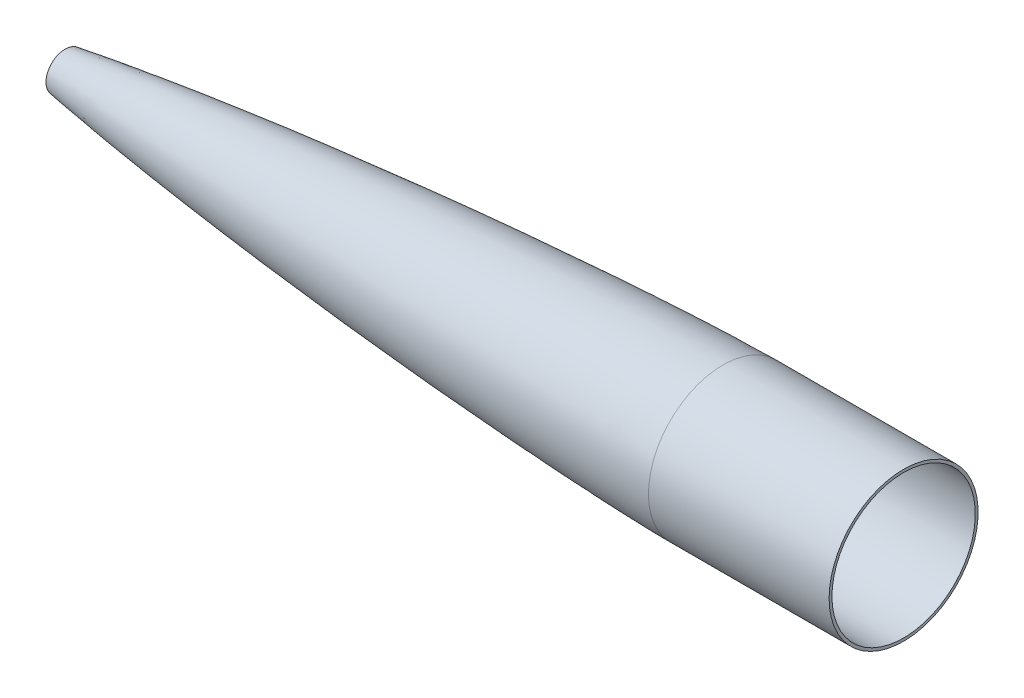
ISO-10303-21;
HEADER;
FILE_DESCRIPTION(('STEP AP214'),'2;1');
FILE_NAME('part.step','',(''),(''),'','','');
FILE_SCHEMA(('AUTOMOTIVE_DESIGN { 1 0 10303 214 1 1 1 1 }'));
ENDSEC;
DATA;
#1=APPLICATION_CONTEXT('core data for automotive mechanical design processes');
#2=APPLICATION_PROTOCOL_DEFINITION('international standard','automotive_design',2000,#1);
#3=PRODUCT_CONTEXT('',#1,'mechanical');
#4=PRODUCT('Part','Part','',(#3));
#5=PRODUCT_RELATED_PRODUCT_CATEGORY('part','',(#4));
#6=PRODUCT_DEFINITION_FORMATION('','',#4);
#7=PRODUCT_DEFINITION_CONTEXT('part definition',#1,'design');
#8=PRODUCT_DEFINITION('design','',#6,#7);
#9=PRODUCT_DEFINITION_SHAPE('','',#8);
#10=(LENGTH_UNIT() NAMED_UNIT(*) SI_UNIT(.MILLI.,.METRE.));
#11=(NAMED_UNIT(*) PLANE_ANGLE_UNIT() SI_UNIT($,.RADIAN.));
#12=(NAMED_UNIT(*) SI_UNIT($,.STERADIAN.) SOLID_ANGLE_UNIT());
#13=UNCERTAINTY_MEASURE_WITH_UNIT(LENGTH_MEASURE(1.E-05),#10,'distance_accuracy_value','');
#14=(GEOMETRIC_REPRESENTATION_CONTEXT(3) GLOBAL_UNCERTAINTY_ASSIGNED_CONTEXT((#13)) GLOBAL_UNIT_ASSIGNED_CONTEXT((#10,
#11,#12)) REPRESENTATION_CONTEXT('',''));
#15=CARTESIAN_POINT('',(0.,0.,0.));
#16=DIRECTION('',(0.,0.,1.));
#17=DIRECTION('',(1.,0.,0.));
#18=AXIS2_PLACEMENT_3D('',#15,#16,#17);
#19=CARTESIAN_POINT('',(-497.100050165792,-29.1260697314375,34.219815841027));
#20=DIRECTION('',(-1.,0.,0.));
#21=DIRECTION('',(0.,0.,1.));
#22=AXIS2_PLACEMENT_3D('',#19,#20,#21);
#23=TOROIDAL_SURFACE('',#22,19.05,9.525);
#24=CARTESIAN_POINT('',(-487.719756318354,-29.1260697314375,34.219815841027));
#25=DIRECTION('',(1.,0.,0.));
#26=DIRECTION('',(0.,0.,-1.));
#27=AXIS2_PLACEMENT_3D('',#24,#25,#26);
#28=CIRCLE('',#27,17.3960011077034);
#29=CARTESIAN_POINT('',(-487.719756318354,-29.1260697314375,16.8238147333237));
#30=VERTEX_POINT('',#29);
#31=EDGE_CURVE('E192',#30,#30,#28,.T.);
#32=ORIENTED_EDGE('',*,*,#31,.T.);
#33=EDGE_LOOP('',(#32));
#34=FACE_BOUND('',#33,.T.);
#35=CARTESIAN_POINT('',(-488.301278228721,-29.1260697314375,34.219815841027));
#36=DIRECTION('',(-1.,0.,0.));
#37=DIRECTION('',(0.,0.,1.));
#38=AXIS2_PLACEMENT_3D('',#35,#36,#37);
#39=CIRCLE('',#38,15.4020913663565);
#40=CARTESIAN_POINT('',(-488.301278228721,-29.1260697314375,49.6219072073836));
#41=VERTEX_POINT('',#40);
#42=EDGE_CURVE('E36',#41,#41,#39,.T.);
#43=ORIENTED_EDGE('',*,*,#42,.T.);
#44=EDGE_LOOP('',(#43));
#45=FACE_BOUND('',#44,.T.);
#46=ADVANCED_FACE('F32',(#34,#45),#23,.T.);
#47=CARTESIAN_POINT('',(-490.226191636893,-29.1260697314375,34.219815841027));
#48=DIRECTION('',(1.,0.,0.));
#49=DIRECTION('',(0.,0.,-1.));
#50=AXIS2_PLACEMENT_3D('',#47,#48,#49);
#51=CONICAL_SURFACE('',#50,21.4653963375631,1.39626340159342);
#52=CARTESIAN_POINT('',(-490.846520934166,-29.1260697314375,34.219815841027));
#53=DIRECTION('',(1.,0.,0.));
#54=DIRECTION('',(0.,0.,-1.));
#55=AXIS2_PLACEMENT_3D('',#52,#53,#54);
#56=CIRCLE('',#55,17.9473340718022);
#57=CARTESIAN_POINT('',(-490.846520934166,-29.1260697314375,16.2724817692248));
#58=VERTEX_POINT('',#57);
#59=EDGE_CURVE('E99',#58,#58,#56,.T.);
#60=ORIENTED_EDGE('',*,*,#59,.T.);
#61=EDGE_LOOP('',(#60));
#62=FACE_BOUND('',#61,.T.);
#63=CARTESIAN_POINT('',(-490.226191636893,-29.1260697314375,34.219815841027));
#64=DIRECTION('',(-1.,0.,0.));
#65=DIRECTION('',(0.,0.,1.));
#66=AXIS2_PLACEMENT_3D('',#63,#64,#65);
#67=CIRCLE('',#66,21.4653963375631);
#68=CARTESIAN_POINT('',(-490.226191636893,-29.1260697314375,55.6852121785901));
#69=VERTEX_POINT('',#68);
#70=EDGE_CURVE('E44',#69,#69,#67,.T.);
#71=ORIENTED_EDGE('',*,*,#70,.T.);
#72=EDGE_LOOP('',(#71));
#73=FACE_BOUND('',#72,.T.);
#74=ADVANCED_FACE('F85',(#62,#73),#51,.T.);
#75=CARTESIAN_POINT('',(257.178547359631,-29.1260697314381,118.058414165423));
#76=CARTESIAN_POINT('',(255.320899442672,-29.1260697314381,118.053764584324));
#77=CARTESIAN_POINT('',(253.463251525713,-29.1260697314381,118.049115003225));
#78=CARTESIAN_POINT('',(251.605603608755,-29.1260697314381,118.044465422126));
#79=CARTESIAN_POINT('',(249.747955691796,-29.1260697314381,118.039815841027));
#80=CARTESIAN_POINT('',(247.037204587574,-29.1260697314381,118.033030993918));
#81=CARTESIAN_POINT('',(241.615892749251,-29.1260697314381,117.981603725061));
#82=CARTESIAN_POINT('',(230.774019349644,-29.1260697314381,117.820517181401));
#83=CARTESIAN_POINT('',(213.457799954454,-29.1260697314381,117.433496013967));
#84=CARTESIAN_POINT('',(192.379641652368,-29.126069731438,116.816839150635));
#85=CARTESIAN_POINT('',(161.068693107867,-29.126069731438,115.689740348816));
#86=CARTESIAN_POINT('',(122.241235941685,-29.126069731438,113.988999174482));
#87=CARTESIAN_POINT('',(76.9597173213895,-29.126069731438,111.644045536759));
#88=CARTESIAN_POINT('',(25.2331815247483,-29.126069731438,108.541239256283));
#89=CARTESIAN_POINT('',(-26.4689224169223,-29.126069731438,105.055962688181));
#90=CARTESIAN_POINT('',(-78.1453992899658,-29.1260697314379,101.209907448607));
#91=CARTESIAN_POINT('',(-129.794537127088,-29.1260697314379,97.0125928680635));
#92=CARTESIAN_POINT('',(-181.413804983064,-29.1260697314379,92.4627350675098));
#93=CARTESIAN_POINT('',(-232.999839264732,-29.1260697314378,87.5496015046126));
#94=CARTESIAN_POINT('',(-284.547598412156,-29.1260697314378,82.249774320463));
#95=CARTESIAN_POINT('',(-336.050232479862,-29.1260697314378,76.5260238420661));
#96=CARTESIAN_POINT('',(-387.496474424648,-29.1260697314377,70.314936150988));
#97=CARTESIAN_POINT('',(-432.48003869913,-29.1260697314377,64.3629107800199));
#98=CARTESIAN_POINT('',(-464.564279917598,-29.1260697314376,59.7061827137547));
#99=CARTESIAN_POINT('',(-483.797715701709,-29.1260697314376,56.7125369941234));
#100=CARTESIAN_POINT('',(-490.226191636893,-29.1260697314376,55.6852121785901));
#101=CARTESIAN_POINT('',(-492.078911817164,-29.1260697314376,55.3891318266339));
#102=CARTESIAN_POINT('',(-493.931631997434,-29.1260697314376,55.0930514746777));
#103=CARTESIAN_POINT('',(-495.784352177705,-29.1260697314376,54.7969711227215));
#104=CARTESIAN_POINT('',(-497.637072357976,-29.1260697314376,54.5008907707654));
#105=B_SPLINE_CURVE_WITH_KNOTS('',4,(#75,#76,#77,#78,#79,#80,#81,#82,#83,#84,#85,#86,#87,#88,
#89,#90,#91,#92,#93,#94,#95,#96,#97,#98,#99,#100,#101,#102,#103,#104),.UNSPECIFIED.,.F.,.F.,(5,
4,1,1,1,1,1,1,1,1,1,1,1,1,1,1,1,1,1,4,5),(0.110650562347268,0.119456002324028,0.132305238135753,
0.145154473947477,0.170852945570926,0.20155636317632,0.232259780781714,0.293666616471375,
0.355073450910404,0.416480286041621,0.477887121742557,0.539293956594942,0.600700791172677,
0.662107626008528,0.72351446097545,0.784921295902826,0.846328130529149,0.907734964455163,
0.969141797456508,1.,1.00889349437653),.UNSPECIFIED.);
#106=CARTESIAN_POINT('',(467.335847272882,-29.1260697314375,34.219815841027));
#107=DIRECTION('',(-1.,0.,0.));
#108=AXIS1_PLACEMENT('',#106,#107);
#109=SURFACE_OF_REVOLUTION('',#105,#108);
#110=ORIENTED_EDGE('',*,*,#70,.F.);
#111=EDGE_LOOP('',(#110));
#112=FACE_BOUND('',#111,.T.);
#113=CARTESIAN_POINT('',(249.747955691796,-29.1260697314375,34.219815841027));
#114=DIRECTION('',(-1.,0.,0.));
#115=DIRECTION('',(0.,0.,1.));
#116=AXIS2_PLACEMENT_3D('',#113,#114,#115);
#117=CIRCLE('',#116,83.8199999999999);
#118=CARTESIAN_POINT('',(249.747955691796,-29.1260697314375,118.039815841027));
#119=VERTEX_POINT('',#118);
#120=EDGE_CURVE('E40',#119,#119,#117,.T.);
#121=ORIENTED_EDGE('',*,*,#120,.T.);
#122=EDGE_LOOP('',(#121));
#123=FACE_BOUND('',#122,.T.);
#124=ADVANCED_FACE('F90',(#112,#123),#109,.T.);
#125=CARTESIAN_POINT('',(467.335847272882,-29.1260697314375,34.219815841027));
#126=DIRECTION('',(-1.,0.,0.));
#127=DIRECTION('',(0.,0.,1.));
#128=AXIS2_PLACEMENT_3D('',#125,#126,#127);
#129=CYLINDRICAL_SURFACE('',#128,83.8199999999999);
#130=ORIENTED_EDGE('',*,*,#120,.F.);
#131=EDGE_LOOP('',(#130));
#132=FACE_BOUND('',#131,.T.);
#133=CARTESIAN_POINT('',(452.947955691796,-29.1260697314375,34.219815841027));
#134=DIRECTION('',(-1.,0.,0.));
#135=DIRECTION('',(0.,0.,1.));
#136=AXIS2_PLACEMENT_3D('',#133,#134,#135);
#137=CIRCLE('',#136,83.8199999999999);
#138=CARTESIAN_POINT('',(452.947955691796,-29.1260697314375,118.039815841027));
#139=VERTEX_POINT('',#138);
#140=EDGE_CURVE('E10',#139,#139,#137,.T.);
#141=ORIENTED_EDGE('',*,*,#140,.T.);
#142=EDGE_LOOP('',(#141));
#143=FACE_BOUND('',#142,.T.);
#144=ADVANCED_FACE('F34',(#132,#143),#129,.T.);
#145=CARTESIAN_POINT('',(452.947955691796,-29.1260697314375,34.219815841027));
#146=DIRECTION('',(1.,0.,0.));
#147=DIRECTION('',(0.,1.,0.));
#148=AXIS2_PLACEMENT_3D('',#145,#146,#147);
#149=PLANE('',#148);
#150=CARTESIAN_POINT('',(452.947955691796,-29.1260697314375,34.219815841027));
#151=DIRECTION('',(1.,0.,0.));
#152=DIRECTION('',(0.,1.,0.));
#153=AXIS2_PLACEMENT_3D('',#150,#151,#152);
#154=CIRCLE('',#153,80.6449999999999);
#155=CARTESIAN_POINT('',(452.947955691796,51.5189302685625,34.219815841027));
#156=VERTEX_POINT('',#155);
#157=EDGE_CURVE('E49',#156,#156,#154,.F.);
#158=ORIENTED_EDGE('',*,*,#157,.T.);
#159=EDGE_LOOP('',(#158));
#160=FACE_BOUND('',#159,.T.);
#161=ORIENTED_EDGE('',*,*,#140,.F.);
#162=EDGE_LOOP('',(#161));
#163=FACE_BOUND('',#162,.T.);
#164=ADVANCED_FACE('F81',(#160,#163),#149,.T.);
#165=CARTESIAN_POINT('',(-487.099427021081,-29.1260697314375,34.219815841027));
#166=DIRECTION('',(1.,0.,0.));
#167=DIRECTION('',(0.,0.,-1.));
#168=AXIS2_PLACEMENT_3D('',#165,#166,#167);
#169=CONICAL_SURFACE('',#168,20.9140633734642,1.39626340159342);
#170=ORIENTED_EDGE('',*,*,#31,.F.);
#171=EDGE_LOOP('',(#170));
#172=FACE_BOUND('',#171,.T.);
#173=CARTESIAN_POINT('',(-487.49232966141,-29.1260697314375,34.219815841027));
#174=DIRECTION('',(-1.,0.,0.));
#175=DIRECTION('',(0.,0.,1.));
#176=AXIS2_PLACEMENT_3D('',#173,#174,#175);
#177=CIRCLE('',#176,18.6858017725101);
#178=CARTESIAN_POINT('',(-487.49232966141,-29.1260697314375,52.9056176135371));
#179=VERTEX_POINT('',#178);
#180=EDGE_CURVE('E198',#179,#179,#177,.T.);
#181=ORIENTED_EDGE('',*,*,#180,.F.);
#182=EDGE_LOOP('',(#181));
#183=FACE_BOUND('',#182,.T.);
#184=ADVANCED_FACE('F78',(#172,#183),#169,.F.);
#185=CARTESIAN_POINT('',(257.178547359631,-29.1260697314381,118.058414165423));
#186=CARTESIAN_POINT('',(255.320899442672,-29.1260697314381,118.053764584324));
#187=CARTESIAN_POINT('',(253.463251525713,-29.1260697314381,118.049115003225));
#188=CARTESIAN_POINT('',(251.605603608755,-29.1260697314381,118.044465422126));
#189=CARTESIAN_POINT('',(247.037204587574,-29.1260697314381,118.033030993918));
#190=CARTESIAN_POINT('',(241.615892749251,-29.1260697314381,117.981603725061));
#191=CARTESIAN_POINT('',(230.774019349644,-29.1260697314381,117.820517181401));
#192=CARTESIAN_POINT('',(213.457799954454,-29.1260697314381,117.433496013967));
#193=CARTESIAN_POINT('',(192.379641652368,-29.126069731438,116.816839150635));
#194=CARTESIAN_POINT('',(161.068693107867,-29.126069731438,115.689740348816));
#195=CARTESIAN_POINT('',(122.241235941685,-29.126069731438,113.988999174482));
#196=CARTESIAN_POINT('',(76.9597173213895,-29.126069731438,111.644045536759));
#197=CARTESIAN_POINT('',(25.2331815247483,-29.126069731438,108.541239256283));
#198=CARTESIAN_POINT('',(-26.4689224169223,-29.126069731438,105.055962688181));
#199=CARTESIAN_POINT('',(-78.1453992899658,-29.1260697314379,101.209907448607));
#200=CARTESIAN_POINT('',(-129.794537127088,-29.1260697314379,97.0125928680635));
#201=CARTESIAN_POINT('',(-181.413804983064,-29.1260697314379,92.4627350675098));
#202=CARTESIAN_POINT('',(-232.999839264732,-29.1260697314378,87.5496015046126));
#203=CARTESIAN_POINT('',(-284.547598412156,-29.1260697314378,82.249774320463));
#204=CARTESIAN_POINT('',(-336.050232479862,-29.1260697314378,76.5260238420661));
#205=CARTESIAN_POINT('',(-387.496474424648,-29.1260697314377,70.314936150988));
#206=CARTESIAN_POINT('',(-432.48003869913,-29.1260697314377,64.3629107800199));
#207=CARTESIAN_POINT('',(-464.564279917598,-29.1260697314376,59.7061827137547));
#208=CARTESIAN_POINT('',(-483.797715701709,-29.1260697314376,56.7125369941234));
#209=CARTESIAN_POINT('',(-492.078911817164,-29.1260697314376,55.3891318266339));
#210=CARTESIAN_POINT('',(-493.931631997434,-29.1260697314376,55.0930514746777));
#211=CARTESIAN_POINT('',(-495.784352177705,-29.1260697314376,54.7969711227215));
#212=CARTESIAN_POINT('',(-497.637072357976,-29.1260697314376,54.5008907707654));
#213=B_SPLINE_CURVE_WITH_KNOTS('',4,(#185,#186,#187,#188,#189,#190,#191,#192,#193,#194,#195,
#196,#197,#198,#199,#200,#201,#202,#203,#204,#205,#206,#207,#208,#209,#210,#211,#212),
.UNSPECIFIED.,.F.,.F.,(5,3,1,1,1,1,1,1,1,1,1,1,1,1,1,1,1,1,1,3,5),(0.110650562347268,
0.119456002324028,0.132305238135753,0.145154473947477,0.170852945570926,0.20155636317632,
0.232259780781714,0.293666616471375,0.355073450910404,0.416480286041621,0.477887121742557,
0.539293956594942,0.600700791172677,0.662107626008528,0.72351446097545,0.784921295902826,
0.846328130529149,0.907734964455163,0.969141797456508,1.,1.00889349437653),.UNSPECIFIED.);
#214=CARTESIAN_POINT('',(467.335847272882,-29.1260697314375,34.219815841027));
#215=DIRECTION('',(-1.,0.,0.));
#216=AXIS1_PLACEMENT('',#214,#215);
#217=SURFACE_OF_REVOLUTION('',#213,#216);
#218=OFFSET_SURFACE('',#217,-3.175,.F.);
#219=ORIENTED_EDGE('',*,*,#180,.T.);
#220=EDGE_LOOP('',(#219));
#221=FACE_BOUND('',#220,.T.);
#222=CARTESIAN_POINT('',(249.755903795145,-29.1260697314369,-46.4251941073896));
#223=CARTESIAN_POINT('',(249.755903795141,-27.8065175092902,-46.4252220983673));
#224=CARTESIAN_POINT('',(249.755903795136,-26.4869676689013,-46.3928084524516));
#225=CARTESIAN_POINT('',(249.755903795132,-23.851045625336,-46.2632988696894));
#226=CARTESIAN_POINT('',(249.755903795134,-22.5346734221594,-46.1662029328441));
#227=CARTESIAN_POINT('',(249.755903795151,-19.9082795267117,-45.9075297510831));
#228=CARTESIAN_POINT('',(249.755903795168,-18.5982578344403,-45.7459525061696));
#229=CARTESIAN_POINT('',(249.755903795162,-15.9877204842093,-45.3587147854985));
#230=CARTESIAN_POINT('',(249.755903795139,-14.6872048262503,-45.133054309737));
#231=CARTESIAN_POINT('',(249.75590379513,-12.098812716983,-44.6181913989709));
#232=CARTESIAN_POINT('',(249.755903795143,-10.8109362656749,-44.3289889639651));
#233=CARTESIAN_POINT('',(249.755903795147,-8.25092514588111,-43.6877394822324));
#234=CARTESIAN_POINT('',(249.755903795137,-6.97879047739431,-43.3356924355101));
#235=CARTESIAN_POINT('',(249.755903795123,-4.45332761525791,-42.5696016727343));
#236=CARTESIAN_POINT('',(249.755903795118,-3.19999942160936,-42.1555579566775));
#237=CARTESIAN_POINT('',(249.755903795136,-0.715168884519429,-41.2664713683567));
#238=CARTESIAN_POINT('',(249.755903795158,0.516333458924319,-40.7914284960994));
#239=CARTESIAN_POINT('',(249.755903795169,2.95454549836648,-39.7814880029469));
#240=CARTESIAN_POINT('',(249.755903795157,4.16125519436018,-39.2465903820404));
#241=CARTESIAN_POINT('',(249.755903795148,6.54697486929668,-38.1182290102299));
#242=CARTESIAN_POINT('',(249.755903795151,7.72598484824346,-37.5247652593343));
#243=CARTESIAN_POINT('',(249.75590379516,10.053464750925,-36.2807013327576));
#244=CARTESIAN_POINT('',(249.755903795165,11.2019346746595,-35.6301011570759));
#245=CARTESIAN_POINT('',(249.755903795156,13.4655677023138,-34.2733317339528));
#246=CARTESIAN_POINT('',(249.755903795142,14.5807308062325,-33.5671624865095));
#247=CARTESIAN_POINT('',(249.755903795133,16.7750636685942,-32.1009561434051));
#248=CARTESIAN_POINT('',(249.755903795138,17.8542334270381,-31.3409190477454));
#249=CARTESIAN_POINT('',(249.75590379517,19.9739797840027,-29.7688080041474));
#250=CARTESIAN_POINT('',(249.755903795196,21.0145563825235,-28.9567340562093));
#251=CARTESIAN_POINT('',(249.75590379523,23.0546095795232,-27.2825056652783));
#252=CARTESIAN_POINT('',(249.755903795239,24.0540861780002,-26.4203512222829));
#253=CARTESIAN_POINT('',(249.755903795193,26.0095315481774,-24.6480388468541));
#254=CARTESIAN_POINT('',(249.755903795139,26.9655003198781,-23.7378809144213));
#255=CARTESIAN_POINT('',(249.755903795093,28.8316270239887,-21.8717542103106));
#256=CARTESIAN_POINT('',(249.755903795102,29.7417849563997,-20.9157854386339));
#257=CARTESIAN_POINT('',(249.755903795125,31.5140973318119,-18.9603400684794));
#258=CARTESIAN_POINT('',(249.755903795139,32.3762517748112,-17.9608634699998));
#259=CARTESIAN_POINT('',(249.755903795141,34.0504801657209,-15.9208102730311));
#260=CARTESIAN_POINT('',(249.755903795129,34.8625541136354,-14.8802336745455));
#261=CARTESIAN_POINT('',(249.755903795137,36.4346651572101,-12.7604873176212));
#262=CARTESIAN_POINT('',(249.755903795158,37.1947022528685,-11.6813175591812));
#263=CARTESIAN_POINT('',(249.75590379516,38.6609085960255,-9.48698469676525));
#264=CARTESIAN_POINT('',(249.755903795141,39.3670778435198,-8.37182159278635));
#265=CARTESIAN_POINT('',(249.755903795136,40.723847266612,-6.10818856513443));
#266=CARTESIAN_POINT('',(249.755903795151,41.3744474422181,-4.9597186414663));
#267=CARTESIAN_POINT('',(249.75590379516,42.6185113689456,-2.63223873872371));
#268=CARTESIAN_POINT('',(249.755903795155,43.2119751200575,-1.45322875964415));
#269=CARTESIAN_POINT('',(249.75590379515,44.340336491462,0.932490915314558));
#270=CARTESIAN_POINT('',(249.755903795151,44.8752341117602,2.13920061119107));
#271=CARTESIAN_POINT('',(249.755903795176,45.8851746064052,4.5774126505522));
#272=CARTESIAN_POINT('',(249.755903795201,46.3602174807494,5.8089149940379));
#273=CARTESIAN_POINT('',(249.755903795239,47.2493040635596,8.29374553153637));
#274=CARTESIAN_POINT('',(249.755903795252,47.6633477720264,9.54707372554883));
#275=CARTESIAN_POINT('',(249.755903795191,48.4294385555072,12.0725365866445));
#276=CARTESIAN_POINT('',(249.755903795118,48.7814856305249,13.3446712537265));
#277=CARTESIAN_POINT('',(249.755903795081,49.4227350349037,15.9046823772165));
#278=CARTESIAN_POINT('',(249.755903795118,49.7119373642639,17.1925588336247));
#279=CARTESIAN_POINT('',(249.755903795161,50.2268005635887,19.780950928614));
#280=CARTESIAN_POINT('',(249.755903795167,50.4524614335505,21.0814665671957));
#281=CARTESIAN_POINT('',(249.755903795162,50.8396980772618,23.6920039703982));
#282=CARTESIAN_POINT('',(249.75590379515,51.001273851011,25.0020257350191));
#283=CARTESIAN_POINT('',(249.755903795135,51.2599510520998,27.6284194330753));
#284=CARTESIAN_POINT('',(249.755903795132,51.3570524794415,28.9447913665104));
#285=CARTESIAN_POINT('',(249.755903795137,51.4865470618818,31.5807141469728));
#286=CARTESIAN_POINT('',(249.755903795146,51.5189402169791,32.9002649940002));
#287=CARTESIAN_POINT('',(249.755903795144,51.5189402169791,35.539366688054));
#288=CARTESIAN_POINT('',(249.755903795134,51.4865470618818,36.8589175350803));
#289=CARTESIAN_POINT('',(249.755903795134,51.3570524794418,39.4948403155384));
#290=CARTESIAN_POINT('',(249.755903795144,51.2599510521004,40.8112122489703));
#291=CARTESIAN_POINT('',(249.755903795141,51.0012738510112,43.437605947034));
#292=CARTESIAN_POINT('',(249.755903795127,50.8396980772606,44.7476277116656));
#293=CARTESIAN_POINT('',(249.755903795151,50.4524614335493,47.3581651148638));
#294=CARTESIAN_POINT('',(249.75590379519,50.2268005635902,48.6586807534307));
#295=CARTESIAN_POINT('',(249.755903795239,49.7119373642687,51.2470728484087));
#296=CARTESIAN_POINT('',(249.75590379525,49.4227350349082,52.5349493048201));
#297=CARTESIAN_POINT('',(249.755903795201,48.7814856305072,55.0949604283998));
#298=CARTESIAN_POINT('',(249.755903795141,48.4294385554637,56.3670950955672));
#299=CARTESIAN_POINT('',(249.755903795116,47.6633477719493,58.8925579567444));
#300=CARTESIAN_POINT('',(249.755903795151,47.249304063479,60.1458861507543));
#301=CARTESIAN_POINT('',(249.755903795169,46.3602174806782,62.6307166882027));
#302=CARTESIAN_POINT('',(249.755903795151,45.885174606349,63.8622190316417));
#303=CARTESIAN_POINT('',(249.755903795137,44.8752341117524,66.3004310708774));
#304=CARTESIAN_POINT('',(249.755903795141,44.3403364914892,67.5071407666759));
#305=CARTESIAN_POINT('',(249.755903795152,43.2119751201566,69.8928604414945));
#306=CARTESIAN_POINT('',(249.755903795159,42.618511369081,71.0718704205116));
#307=CARTESIAN_POINT('',(249.755903795152,41.3744474423007,73.3993503233787));
#308=CARTESIAN_POINT('',(249.755903795138,40.7238472665935,74.5478202472273));
#309=CARTESIAN_POINT('',(249.755903795139,39.3670778434682,76.8114532749187));
#310=CARTESIAN_POINT('',(249.755903795152,38.6609085960571,77.9266163787657));
#311=CARTESIAN_POINT('',(249.755903795165,37.1947022529955,80.1209492410517));
#312=CARTESIAN_POINT('',(249.755903795165,36.4346651573432,81.2001189994895));
#313=CARTESIAN_POINT('',(249.755903795144,34.8625541136835,83.3198653565412));
#314=CARTESIAN_POINT('',(249.755903795123,34.0504801656714,84.3604419551516));
#315=CARTESIAN_POINT('',(249.755903795157,32.3762517747228,86.4004951521554));
#316=CARTESIAN_POINT('',(249.75590379521,31.5140973317921,87.3999717505537));
#317=CARTESIAN_POINT('',(249.755903795257,29.7417849564563,89.3554171206278));
#318=CARTESIAN_POINT('',(249.75590379525,28.8316270240495,90.3113858923022));
#319=CARTESIAN_POINT('',(249.755903795185,26.9655003199265,92.1775125964292));
#320=CARTESIAN_POINT('',(249.755903795127,26.0095315482082,93.0876705288798));
#321=CARTESIAN_POINT('',(249.755903795101,24.0540861780675,94.8599829042759));
#322=CARTESIAN_POINT('',(249.755903795132,23.0546095796479,95.7221373472244));
#323=CARTESIAN_POINT('',(249.755903795147,21.0145563826967,97.3963657381263));
#324=CARTESIAN_POINT('',(249.755903795131,19.9739797841644,98.2084396860786));
#325=CARTESIAN_POINT('',(249.755903795136,17.8542334271587,99.7805507297127));
#326=CARTESIAN_POINT('',(249.755903795157,16.7750636686846,100.540587825394));
#327=CARTESIAN_POINT('',(249.755903795161,14.5807308062976,102.006794168525));
#328=CARTESIAN_POINT('',(249.755903795143,13.4655677023851,102.712963415977));
#329=CARTESIAN_POINT('',(249.755903795134,11.2019346746878,104.0697328391));
#330=CARTESIAN_POINT('',(249.755903795144,10.0534647509026,104.72033301477));
#331=CARTESIAN_POINT('',(249.755903795154,7.72598484814904,105.964396941492));
#332=CARTESIAN_POINT('',(249.755903795153,6.54697486918152,106.557860692545));
#333=CARTESIAN_POINT('',(249.755903795151,4.16125519427426,107.686222063928));
#334=CARTESIAN_POINT('',(249.75590379515,2.95454549833302,108.221119684254));
#335=CARTESIAN_POINT('',(249.755903795129,0.516333458969224,109.231060178895));
#336=CARTESIAN_POINT('',(249.75590379511,-0.715168884451782,109.706103053214));
#337=CARTESIAN_POINT('',(249.755903795161,-3.19999942189886,110.595189636008));
#338=CARTESIAN_POINT('',(249.75590379523,-4.45332761592605,111.00923334448));
#339=CARTESIAN_POINT('',(249.755903795213,-6.97879047702736,111.775324127964));
#340=CARTESIAN_POINT('',(249.755903795128,-8.25092514410001,112.127371202979));
#341=CARTESIAN_POINT('',(249.75590379507,-10.8109362675792,112.768620607357));
#342=CARTESIAN_POINT('',(249.755903795098,-12.0988127239861,113.057822936718));
#343=CARTESIAN_POINT('',(249.75590379513,-14.6872048189781,113.572686136045));
#344=CARTESIAN_POINT('',(249.755903795136,-15.9877204575638,113.798347006008));
#345=CARTESIAN_POINT('',(249.755903795143,-18.5982578607746,114.185583649722));
#346=CARTESIAN_POINT('',(249.755903795145,-19.9082796253997,114.347159423472));
#347=CARTESIAN_POINT('',(249.75590379514,-22.5346733234654,114.605836624563));
#348=CARTESIAN_POINT('',(249.755903795133,-23.8510452569058,114.702938051905));
#349=CARTESIAN_POINT('',(249.755903795135,-26.4869680373768,114.832432634346));
#350=CARTESIAN_POINT('',(249.755903795144,-27.8065188844074,114.864825789444));
#351=CARTESIAN_POINT('',(249.755903795146,-30.4456205784687,114.864825789444));
#352=CARTESIAN_POINT('',(249.75590379514,-31.7651714254993,114.832432634346));
#353=CARTESIAN_POINT('',(249.755903795128,-34.4010942059703,114.702938051905));
#354=CARTESIAN_POINT('',(249.755903795123,-35.7174661394107,114.605836624563));
#355=CARTESIAN_POINT('',(249.755903795162,-38.3438598374764,114.347159423472));
#356=CARTESIAN_POINT('',(249.755903795205,-39.6538816021015,114.185583649722));
#357=CARTESIAN_POINT('',(249.755903795231,-42.2644190053123,113.798347006008));
#358=CARTESIAN_POINT('',(249.755903795212,-43.564934643898,113.572686136045));
#359=CARTESIAN_POINT('',(249.755903795217,-46.15332673889,113.057822936718));
#360=CARTESIAN_POINT('',(249.755903795241,-47.4412031952969,112.768620607357));
#361=CARTESIAN_POINT('',(249.75590379521,-50.0012143187699,112.127371202981));
#362=CARTESIAN_POINT('',(249.755903795155,-51.2733489858364,111.775324127967));
#363=CARTESIAN_POINT('',(249.755903795109,-53.7988118469167,111.00923334449));
#364=CARTESIAN_POINT('',(249.755903795117,-55.0521400409291,110.595189636024));
#365=CARTESIAN_POINT('',(249.755903795128,-57.536970578383,109.706103053229));
#366=CARTESIAN_POINT('',(249.755903795132,-58.7684729218248,109.231060178903));
#367=CARTESIAN_POINT('',(249.755903795147,-61.206684961209,108.221119684254));
#368=CARTESIAN_POINT('',(249.755903795158,-62.4133946571503,107.686222063928));
#369=CARTESIAN_POINT('',(249.755903795158,-64.7991143320389,106.557860692554));
#370=CARTESIAN_POINT('',(249.755903795148,-65.9781243109881,105.96439694151));
#371=CARTESIAN_POINT('',(249.755903795138,-68.3056042137625,104.720333014779));
#372=CARTESIAN_POINT('',(249.755903795139,-69.4540741375853,104.069732839088));
#373=CARTESIAN_POINT('',(249.755903795138,-71.71770716532,102.71296341594));
#374=CARTESIAN_POINT('',(249.755903795138,-72.8328702692333,102.006794168486));
#375=CARTESIAN_POINT('',(249.755903795137,-75.0272031316003,100.540587825365));
#376=CARTESIAN_POINT('',(249.755903795137,-76.1063728900541,99.7805507296976));
#377=CARTESIAN_POINT('',(249.755903795161,-78.2261192470626,98.2084396860614));
#378=CARTESIAN_POINT('',(249.755903795185,-79.2666958456165,97.3963657380914));
#379=CARTESIAN_POINT('',(249.755903795208,-81.3067490425204,95.7221373472247));
#380=CARTESIAN_POINT('',(249.755903795206,-82.3062256408749,94.8599829043335));
#381=CARTESIAN_POINT('',(249.755903795171,-84.2616710109758,93.087670528981));
#382=CARTESIAN_POINT('',(249.755903795138,-85.2176397827157,92.1775125965127));
#383=CARTESIAN_POINT('',(249.755903795094,-87.0837664868407,90.3113858923877));
#384=CARTESIAN_POINT('',(249.755903795082,-87.9939244192298,89.355417120735));
#385=CARTESIAN_POINT('',(249.75590379511,-89.7662367946281,87.3999717506006));
#386=CARTESIAN_POINT('',(249.755903795149,-90.6283912376339,86.4004951521158));
#387=CARTESIAN_POINT('',(249.755903795164,-92.302619628571,84.3604419551175));
#388=CARTESIAN_POINT('',(249.755903795141,-93.1146935765057,83.3198653566066));
#389=CARTESIAN_POINT('',(249.755903795126,-94.6868046201376,81.2001189996036));
#390=CARTESIAN_POINT('',(249.755903795135,-95.446841715832,80.1209492411092));
#391=CARTESIAN_POINT('',(249.75590379514,-96.9130480589326,77.9266163787646));
#392=CARTESIAN_POINT('',(249.755903795136,-97.6192173063438,76.8114532749176));
#393=CARTESIAN_POINT('',(249.755903795141,-98.9759867294691,74.5478202472263));
#394=CARTESIAN_POINT('',(249.755903795149,-99.6265869051762,73.3993503233776));
#395=CARTESIAN_POINT('',(249.755903795162,-100.870650831939,71.0718704205436));
#396=CARTESIAN_POINT('',(249.755903795167,-101.464114582998,69.8928604415604));
#397=CARTESIAN_POINT('',(249.755903795149,-102.592475954334,67.5071407667434));
#398=CARTESIAN_POINT('',(249.755903795126,-103.127373574613,66.3004310709109));
#399=CARTESIAN_POINT('',(249.755903795163,-104.137314069224,63.8622190316406));
#400=CARTESIAN_POINT('',(249.755903795223,-104.612356943554,62.6307166882017));
#401=CARTESIAN_POINT('',(249.755903795271,-105.501443526387,60.1458861506624));
#402=CARTESIAN_POINT('',(249.755903795259,-105.915487234885,58.89255795656));
#403=CARTESIAN_POINT('',(249.755903795184,-106.681578018391,56.36709509538));
#404=CARTESIAN_POINT('',(249.755903795119,-107.033625093406,55.0949604283049));
#405=CARTESIAN_POINT('',(249.75590379508,-107.674874497781,52.5349493048272));
#406=CARTESIAN_POINT('',(249.755903795105,-107.96407682714,51.2470728484241));
#407=CARTESIAN_POINT('',(249.755903795121,-108.478940026464,48.6586807534401));
#408=CARTESIAN_POINT('',(249.755903795112,-108.704600896425,47.3581651148584));
#409=CARTESIAN_POINT('',(249.755903795122,-109.091837540124,44.7476277117422));
#410=CARTESIAN_POINT('',(249.755903795139,-109.253413313865,43.4376059472081));
#411=CARTESIAN_POINT('',(249.755903795146,-109.512090514962,40.8112122491517));
#412=CARTESIAN_POINT('',(249.755903795135,-109.609191942312,39.4948403156286));
#413=CARTESIAN_POINT('',(249.755903795133,-109.738686524757,36.8589175350791));
#414=CARTESIAN_POINT('',(249.755903795143,-109.771079679854,35.5393666880528));
#415=CARTESIAN_POINT('',(249.755903795147,-109.771079679854,32.9002649940001));
#416=CARTESIAN_POINT('',(249.75590379514,-109.738686524757,31.5807141469738));
#417=CARTESIAN_POINT('',(249.755903795128,-109.609191942317,28.9447913665114));
#418=CARTESIAN_POINT('',(249.755903795124,-109.512090514975,27.6284194330752));
#419=CARTESIAN_POINT('',(249.755903795162,-109.253413313886,25.0020257350179));
#420=CARTESIAN_POINT('',(249.755903795205,-109.091837540137,23.692003970397));
#421=CARTESIAN_POINT('',(249.75590379523,-108.704600896425,21.0814665671944));
#422=CARTESIAN_POINT('',(249.755903795212,-108.478940026463,19.7809509286128));
#423=CARTESIAN_POINT('',(249.755903795218,-107.964076827139,17.1925588336235));
#424=CARTESIAN_POINT('',(249.755903795242,-107.674874497779,15.9046823772153));
#425=CARTESIAN_POINT('',(249.755903795209,-107.033625093382,13.3446712536564));
#426=CARTESIAN_POINT('',(249.755903795153,-106.681578018344,12.0725365865062));
#427=CARTESIAN_POINT('',(249.755903795107,-105.915487234856,9.54707372541271));
#428=CARTESIAN_POINT('',(249.755903795118,-105.50144352641,8.29374553146841));
#429=CARTESIAN_POINT('',(249.755903795132,-104.612356943618,5.80891499402112));
#430=CARTESIAN_POINT('',(249.755903795135,-104.137314069268,4.57741265051989));
#431=CARTESIAN_POINT('',(249.755903795143,-103.127373574591,2.13920061108617));
#432=CARTESIAN_POINT('',(249.755903795148,-102.592475954265,0.932490915153454));
#433=CARTESIAN_POINT('',(249.755903795157,-101.464114582861,-1.45322875978676));
#434=CARTESIAN_POINT('',(249.755903795161,-100.870650831783,-2.63223873879462));
#435=CARTESIAN_POINT('',(249.75590379515,-99.6265869050925,-4.95971864146732));
#436=CARTESIAN_POINT('',(249.755903795135,-98.9759867294864,-6.10818856513544));
#437=CARTESIAN_POINT('',(249.755903795142,-97.6192173064441,-8.37182159270398));
#438=CARTESIAN_POINT('',(249.755903795163,-96.9130480590039,-9.48698469660195));
#439=CARTESIAN_POINT('',(249.755903795155,-95.4468417158548,-11.6813175590232));
#440=CARTESIAN_POINT('',(249.755903795124,-94.6868046201422,-12.760487317544));
#441=CARTESIAN_POINT('',(249.755903795142,-93.1146935764693,-14.8802336746008));
#442=CARTESIAN_POINT('',(249.755903795191,-92.3026196285118,-15.9208102731389));
#443=CARTESIAN_POINT('',(249.755903795235,-90.628391237599,-17.9608634701011));
#444=CARTESIAN_POINT('',(249.755903795231,-89.7662367946448,-18.960340068526));
#445=CARTESIAN_POINT('',(249.755903795238,-87.9939244192574,-20.9157854386535));
#446=CARTESIAN_POINT('',(249.755903795248,-87.0837664868224,-21.8717542103545));
#447=CARTESIAN_POINT('',(249.755903795205,-85.2176397827533,-23.7378809144191));
#448=CARTESIAN_POINT('',(249.755903795151,-84.2616710111226,-24.6480388467861));
#449=CARTESIAN_POINT('',(249.755903795112,-82.3062256410021,-26.4203512221718));
#450=CARTESIAN_POINT('',(249.755903795127,-81.3067490425079,-27.2825056651855));
#451=CARTESIAN_POINT('',(249.755903795146,-79.266695845535,-28.9567340560996));
#452=CARTESIAN_POINT('',(249.755903795151,-78.2261192470609,-29.7688080040055));
#453=CARTESIAN_POINT('',(249.755903795157,-76.1063728900697,-31.340919047635));
#454=CARTESIAN_POINT('',(249.755903795158,-75.0272031315482,-32.1009561433524));
#455=CARTESIAN_POINT('',(249.75590379516,-72.8328702691249,-33.5671624864978));
#456=CARTESIAN_POINT('',(249.755903795161,-71.7177071652256,-34.2733317339294));
#457=CARTESIAN_POINT('',(249.75590379516,-69.4540741376034,-35.6301011570358));
#458=CARTESIAN_POINT('',(249.755903795158,-68.3056042138814,-36.2807013327121));
#459=CARTESIAN_POINT('',(249.755903795152,-65.9781243111283,-37.524765259331));
#460=CARTESIAN_POINT('',(249.755903795149,-64.799114332095,-38.1182290102694));
#461=CARTESIAN_POINT('',(249.755903795144,-62.4133946571234,-39.2465903820899));
#462=CARTESIAN_POINT('',(249.755903795143,-61.2066849611845,-39.7814880029705));
#463=CARTESIAN_POINT('',(249.755903795184,-58.7684729217982,-40.7914284960999));
#464=CARTESIAN_POINT('',(249.755903795225,-57.5369705783544,-41.2664713683573));
#465=CARTESIAN_POINT('',(249.75590379526,-55.0521400412645,-42.1555579566782));
#466=CARTESIAN_POINT('',(249.755903795255,-53.798811847616,-42.5696016727349));
#467=CARTESIAN_POINT('',(249.755903795181,-51.2733489854795,-43.3356924355105));
#468=CARTESIAN_POINT('',(249.755903795112,-50.0012143169927,-43.6877394822327));
#469=CARTESIAN_POINT('',(249.755903795087,-47.4412031972823,-44.3289889639444));
#470=CARTESIAN_POINT('',(249.75590379513,-46.1533267460586,-44.6181913989335));
#471=CARTESIAN_POINT('',(249.755903795147,-43.564934636878,-45.133054309691));
#472=CARTESIAN_POINT('',(249.75590379512,-42.2644189789203,-45.3587147854564));
#473=CARTESIAN_POINT('',(249.755903795115,-39.6538816286056,-45.7459525061484));
#474=CARTESIAN_POINT('',(249.755903795136,-38.3438599362483,-45.9075297510748));
#475=CARTESIAN_POINT('',(249.755903795149,-35.7174660407154,-46.1662029328441));
#476=CARTESIAN_POINT('',(249.75590379514,-34.4010938375399,-46.2632988696893));
#477=CARTESIAN_POINT('',(249.755903795128,-31.7651717939746,-46.3928084524515));
#478=CARTESIAN_POINT('',(249.755903795125,-30.4456219535847,-46.4252220983673));
#479=CARTESIAN_POINT('',(249.755903795145,-29.1260697314369,-46.4251941073896));
#480=B_SPLINE_CURVE_WITH_KNOTS('',3,(#222,#223,#224,#225,#226,#227,#228,#229,#230,#231,#232,
#233,#234,#235,#236,#237,#238,#239,#240,#241,#242,#243,#244,#245,#246,#247,#248,#249,#250,#251,
#252,#253,#254,#255,#256,#257,#258,#259,#260,#261,#262,#263,#264,#265,#266,#267,#268,#269,#270,
#271,#272,#273,#274,#275,#276,#277,#278,#279,#280,#281,#282,#283,#284,#285,#286,#287,#288,#289,
#290,#291,#292,#293,#294,#295,#296,#297,#298,#299,#300,#301,#302,#303,#304,#305,#306,#307,#308,
#309,#310,#311,#312,#313,#314,#315,#316,#317,#318,#319,#320,#321,#322,#323,#324,#325,#326,#327,
#328,#329,#330,#331,#332,#333,#334,#335,#336,#337,#338,#339,#340,#341,#342,#343,#344,#345,#346,
#347,#348,#349,#350,#351,#352,#353,#354,#355,#356,#357,#358,#359,#360,#361,#362,#363,#364,#365,
#366,#367,#368,#369,#370,#371,#372,#373,#374,#375,#376,#377,#378,#379,#380,#381,#382,#383,#384,
#385,#386,#387,#388,#389,#390,#391,#392,#393,#394,#395,#396,#397,#398,#399,#400,#401,#402,#403,
#404,#405,#406,#407,#408,#409,#410,#411,#412,#413,#414,#415,#416,#417,#418,#419,#420,#421,#422,
#423,#424,#425,#426,#427,#428,#429,#430,#431,#432,#433,#434,#435,#436,#437,#438,#439,#440,#441,
#442,#443,#444,#445,#446,#447,#448,#449,#450,#451,#452,#453,#454,#455,#456,#457,#458,#459,#460,
#461,#462,#463,#464,#465,#466,#467,#468,#469,#470,#471,#472,#473,#474,#475,#476,#477,#478,#479),
.UNSPECIFIED.,.F.,.F.,(4,2,2,2,2,2,2,2,2,2,2,2,2,2,2,2,2,2,2,2,2,2,2,2,2,2,2,2,2,2,2,2,2,2,2,2,
2,2,2,2,2,2,2,2,2,2,2,2,2,2,2,2,2,2,2,2,2,2,2,2,2,2,2,2,2,2,2,2,2,2,2,2,2,2,2,2,2,2,2,2,2,2,2,2,
2,2,2,2,2,2,2,2,2,2,2,2,2,2,2,2,2,2,2,2,2,2,2,2,2,2,2,2,2,2,2,2,2,2,2,2,2,2,2,2,2,2,2,2,4),(0.,
3.95825523680266,7.91651047353657,11.8747657101418,15.833020946991,19.7912761839098,
23.7495314205372,27.7077866573832,31.6660418937981,35.6242971309667,39.5825523675686,
43.5408076042088,47.4990628409816,51.457318077669,55.4155733143511,59.3738285512254,
63.3320837880521,67.2903390247814,71.2485942616697,75.206849498224,79.165104734904,
83.1233599718953,87.0816152083038,91.039870445375,94.9981256820718,98.9563809189422,
102.914636155758,106.872891392338,110.831146628984,114.789401865799,118.747657102632,
122.705912339334,126.664167576104,130.622422812871,134.580678049563,138.538933286429,
142.497188523199,146.455443759854,150.413698996702,154.371954233513,158.330209470237,
162.288464706678,166.246719943533,170.204975180561,174.163230417085,178.121485653749,
182.079740890778,186.037996127348,189.996251364063,193.954506600965,197.912761837618,
201.871017074352,205.829272311154,209.787527547909,213.745782784718,217.70403802141,
221.662293258318,225.62054849498,229.578803731843,233.537058968394,237.495314205036,
241.453569441864,245.41182467871,249.370079915428,253.328335152208,257.286590388988,
261.244845625706,265.203100862552,269.16135609938,273.119611336022,277.077866572555,
281.03612180937,284.994377046098,288.952632283006,292.910887519637,296.869142756575,
300.827397993335,304.785653230065,308.743908466882,312.702163703275,316.66041894026,
320.618674176892,324.576929413805,328.535184650456,332.493439887331,336.451695123855,
340.409950360884,344.368205597627,348.32646083418,352.284716070903,356.242971308004,
360.201226544562,364.159481781192,368.117737018007,372.075992254579,376.034247491545,
379.992502728312,383.95075796508,387.909013201785,391.867268438618,395.825523675433,
399.783778912079,403.742034148872,407.700289385474,411.658544622395,415.616799859279,
419.575055096113,423.533310332521,427.491565569221,431.449820806192,435.40807604295,
439.366331279626,443.324586516457,447.282841752996,451.241096989946,455.199352226458,
459.157607463435,463.11586270014,467.07411793674,471.032373173631,474.990628410618,
478.948883647033,482.907138883879,486.865394120507,490.823649357168,494.781904594015,
498.74015983088,502.698415067611,506.656670304417),.UNSPECIFIED.);
#481=CARTESIAN_POINT('',(249.755903795145,-29.1260697314369,-46.4251941073896));
#482=VERTEX_POINT('',#481);
#483=EDGE_CURVE('E56',#482,#482,#480,.F.);
#484=ORIENTED_EDGE('',*,*,#483,.F.);
#485=EDGE_LOOP('',(#484));
#486=FACE_BOUND('',#485,.T.);
#487=ADVANCED_FACE('F74',(#221,#486),#218,.F.);
#488=CARTESIAN_POINT('',(467.335847272882,-29.1260697314375,34.219815841027));
#489=DIRECTION('',(-1.,0.,0.));
#490=DIRECTION('',(0.,0.,1.));
#491=AXIS2_PLACEMENT_3D('',#488,#489,#490);
#492=CYLINDRICAL_SURFACE('',#491,80.6449999999999);
#493=ORIENTED_EDGE('',*,*,#483,.T.);
#494=EDGE_LOOP('',(#493));
#495=FACE_BOUND('',#494,.T.);
#496=ORIENTED_EDGE('',*,*,#157,.F.);
#497=EDGE_LOOP('',(#496));
#498=FACE_BOUND('',#497,.T.);
#499=ADVANCED_FACE('F63',(#495,#498),#492,.F.);
#500=CARTESIAN_POINT('',(-490.846520934166,-29.1260697314375,34.219815841027));
#501=DIRECTION('',(-1.,0.,0.));
#502=DIRECTION('',(0.,0.,-1.));
#503=AXIS2_PLACEMENT_3D('',#500,#501,#502);
#504=CONICAL_SURFACE('',#503,17.9473340718022,0.78539816339745);
#505=ORIENTED_EDGE('',*,*,#42,.F.);
#506=EDGE_LOOP('',(#505));
#507=FACE_BOUND('',#506,.T.);
#508=ORIENTED_EDGE('',*,*,#59,.F.);
#509=EDGE_LOOP('',(#508));
#510=FACE_BOUND('',#509,.T.);
#511=ADVANCED_FACE('F73',(#507,#510),#504,.F.);
#512=CLOSED_SHELL('',(#46,#74,#124,#144,#164,#184,#487,#499,#511));
#513=MANIFOLD_SOLID_BREP('B2',#512);
#514=ADVANCED_BREP_SHAPE_REPRESENTATION('',(#18,#513),#14);
#515=SHAPE_DEFINITION_REPRESENTATION(#9,#514);
ENDSEC;
END-ISO-10303-21;
